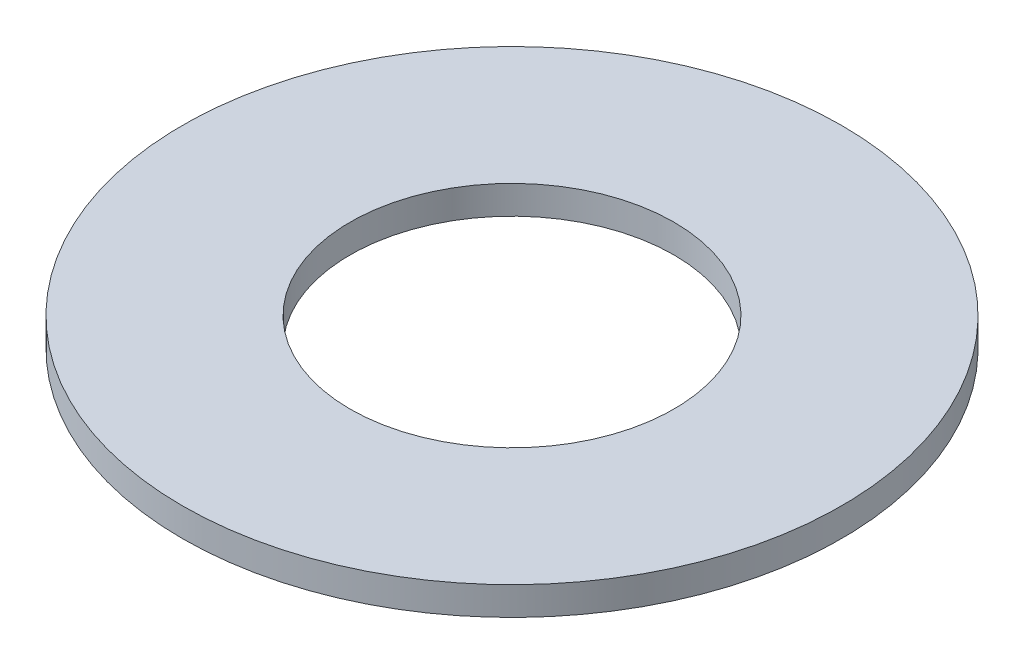
ISO-10303-21;
HEADER;
FILE_DESCRIPTION(('STEP AP214'),'2;1');
FILE_NAME('part.step','',(''),(''),'','','');
FILE_SCHEMA(('AUTOMOTIVE_DESIGN { 1 0 10303 214 1 1 1 1 }'));
ENDSEC;
DATA;
#1=APPLICATION_CONTEXT('core data for automotive mechanical design processes');
#2=APPLICATION_PROTOCOL_DEFINITION('international standard','automotive_design',2000,#1);
#3=PRODUCT_CONTEXT('',#1,'mechanical');
#4=PRODUCT('Part','Part','',(#3));
#5=PRODUCT_RELATED_PRODUCT_CATEGORY('part','',(#4));
#6=PRODUCT_DEFINITION_FORMATION('','',#4);
#7=PRODUCT_DEFINITION_CONTEXT('part definition',#1,'design');
#8=PRODUCT_DEFINITION('design','',#6,#7);
#9=PRODUCT_DEFINITION_SHAPE('','',#8);
#10=(LENGTH_UNIT() NAMED_UNIT(*) SI_UNIT(.MILLI.,.METRE.));
#11=(NAMED_UNIT(*) PLANE_ANGLE_UNIT() SI_UNIT($,.RADIAN.));
#12=(NAMED_UNIT(*) SI_UNIT($,.STERADIAN.) SOLID_ANGLE_UNIT());
#13=UNCERTAINTY_MEASURE_WITH_UNIT(LENGTH_MEASURE(1.E-05),#10,'distance_accuracy_value','');
#14=(GEOMETRIC_REPRESENTATION_CONTEXT(3) GLOBAL_UNCERTAINTY_ASSIGNED_CONTEXT((#13)) GLOBAL_UNIT_ASSIGNED_CONTEXT((#10,
#11,#12)) REPRESENTATION_CONTEXT('',''));
#15=CARTESIAN_POINT('',(0.,0.,0.));
#16=DIRECTION('',(0.,0.,1.));
#17=DIRECTION('',(1.,0.,0.));
#18=AXIS2_PLACEMENT_3D('',#15,#16,#17);
#19=CARTESIAN_POINT('',(0.,0.5,0.));
#20=DIRECTION('',(0.,1.,0.));
#21=DIRECTION('',(0.,0.,1.));
#22=AXIS2_PLACEMENT_3D('',#19,#20,#21);
#23=PLANE('',#22);
#24=CARTESIAN_POINT('',(0.,0.5,0.));
#25=DIRECTION('',(0.,1.,0.));
#26=DIRECTION('',(0.,0.,1.));
#27=AXIS2_PLACEMENT_3D('',#24,#25,#26);
#28=CIRCLE('',#27,5.8);
#29=CARTESIAN_POINT('',(0.,0.5,5.8));
#30=VERTEX_POINT('',#29);
#31=EDGE_CURVE('E10',#30,#30,#28,.T.);
#32=ORIENTED_EDGE('',*,*,#31,.T.);
#33=EDGE_LOOP('',(#32));
#34=FACE_BOUND('',#33,.T.);
#35=CARTESIAN_POINT('',(0.,0.5,0.));
#36=DIRECTION('',(0.,1.,0.));
#37=DIRECTION('',(0.,0.,1.));
#38=AXIS2_PLACEMENT_3D('',#35,#36,#37);
#39=CIRCLE('',#38,2.85);
#40=CARTESIAN_POINT('',(0.,0.5,2.85));
#41=VERTEX_POINT('',#40);
#42=EDGE_CURVE('E43',#41,#41,#39,.T.);
#43=ORIENTED_EDGE('',*,*,#42,.F.);
#44=EDGE_LOOP('',(#43));
#45=FACE_BOUND('',#44,.T.);
#46=ADVANCED_FACE('F32',(#34,#45),#23,.T.);
#47=CARTESIAN_POINT('',(0.,0.,0.));
#48=DIRECTION('',(0.,1.,0.));
#49=DIRECTION('',(0.,0.,1.));
#50=AXIS2_PLACEMENT_3D('',#47,#48,#49);
#51=PLANE('',#50);
#52=CARTESIAN_POINT('',(0.,0.,0.));
#53=DIRECTION('',(0.,1.,0.));
#54=DIRECTION('',(0.,0.,1.));
#55=AXIS2_PLACEMENT_3D('',#52,#53,#54);
#56=CIRCLE('',#55,5.8);
#57=CARTESIAN_POINT('',(0.,0.,5.8));
#58=VERTEX_POINT('',#57);
#59=EDGE_CURVE('E36',#58,#58,#56,.T.);
#60=ORIENTED_EDGE('',*,*,#59,.F.);
#61=EDGE_LOOP('',(#60));
#62=FACE_BOUND('',#61,.T.);
#63=CARTESIAN_POINT('',(0.,0.,0.));
#64=DIRECTION('',(0.,1.,0.));
#65=DIRECTION('',(0.,0.,1.));
#66=AXIS2_PLACEMENT_3D('',#63,#64,#65);
#67=CIRCLE('',#66,2.85);
#68=CARTESIAN_POINT('',(0.,0.,2.85));
#69=VERTEX_POINT('',#68);
#70=EDGE_CURVE('E45',#69,#69,#67,.T.);
#71=ORIENTED_EDGE('',*,*,#70,.T.);
#72=EDGE_LOOP('',(#71));
#73=FACE_BOUND('',#72,.T.);
#74=ADVANCED_FACE('F55',(#62,#73),#51,.F.);
#75=CARTESIAN_POINT('',(0.,0.5,0.));
#76=DIRECTION('',(0.,-1.,0.));
#77=DIRECTION('',(0.,0.,-1.));
#78=AXIS2_PLACEMENT_3D('',#75,#76,#77);
#79=CYLINDRICAL_SURFACE('',#78,5.8);
#80=ORIENTED_EDGE('',*,*,#31,.F.);
#81=EDGE_LOOP('',(#80));
#82=FACE_BOUND('',#81,.T.);
#83=ORIENTED_EDGE('',*,*,#59,.T.);
#84=EDGE_LOOP('',(#83));
#85=FACE_BOUND('',#84,.T.);
#86=ADVANCED_FACE('F34',(#82,#85),#79,.T.);
#87=CARTESIAN_POINT('',(0.,0.5,0.));
#88=DIRECTION('',(0.,-1.,0.));
#89=DIRECTION('',(0.,0.,-1.));
#90=AXIS2_PLACEMENT_3D('',#87,#88,#89);
#91=CYLINDRICAL_SURFACE('',#90,2.85);
#92=ORIENTED_EDGE('',*,*,#42,.T.);
#93=EDGE_LOOP('',(#92));
#94=FACE_BOUND('',#93,.T.);
#95=ORIENTED_EDGE('',*,*,#70,.F.);
#96=EDGE_LOOP('',(#95));
#97=FACE_BOUND('',#96,.T.);
#98=ADVANCED_FACE('F51',(#94,#97),#91,.F.);
#99=CLOSED_SHELL('',(#46,#74,#86,#98));
#100=MANIFOLD_SOLID_BREP('B2',#99);
#101=ADVANCED_BREP_SHAPE_REPRESENTATION('',(#18,#100),#14);
#102=SHAPE_DEFINITION_REPRESENTATION(#9,#101);
ENDSEC;
END-ISO-10303-21;
